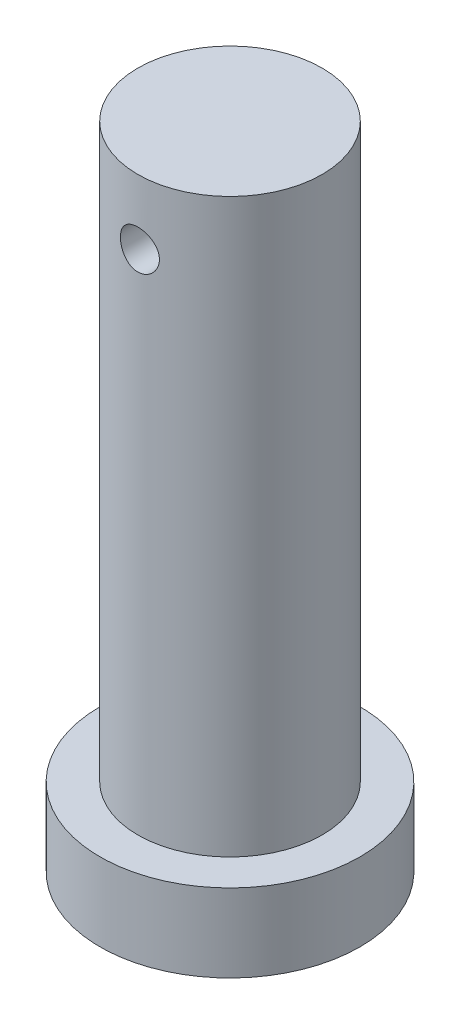
ISO-10303-21;
HEADER;
FILE_DESCRIPTION(('STEP AP214'),'2;1');
FILE_NAME('part.step','',(''),(''),'','','');
FILE_SCHEMA(('AUTOMOTIVE_DESIGN { 1 0 10303 214 1 1 1 1 }'));
ENDSEC;
DATA;
#1=APPLICATION_CONTEXT('core data for automotive mechanical design processes');
#2=APPLICATION_PROTOCOL_DEFINITION('international standard','automotive_design',2000,#1);
#3=PRODUCT_CONTEXT('',#1,'mechanical');
#4=PRODUCT('Part','Part','',(#3));
#5=PRODUCT_RELATED_PRODUCT_CATEGORY('part','',(#4));
#6=PRODUCT_DEFINITION_FORMATION('','',#4);
#7=PRODUCT_DEFINITION_CONTEXT('part definition',#1,'design');
#8=PRODUCT_DEFINITION('design','',#6,#7);
#9=PRODUCT_DEFINITION_SHAPE('','',#8);
#10=(LENGTH_UNIT() NAMED_UNIT(*) SI_UNIT(.MILLI.,.METRE.));
#11=(NAMED_UNIT(*) PLANE_ANGLE_UNIT() SI_UNIT($,.RADIAN.));
#12=(NAMED_UNIT(*) SI_UNIT($,.STERADIAN.) SOLID_ANGLE_UNIT());
#13=UNCERTAINTY_MEASURE_WITH_UNIT(LENGTH_MEASURE(1.E-05),#10,'distance_accuracy_value','');
#14=(GEOMETRIC_REPRESENTATION_CONTEXT(3) GLOBAL_UNCERTAINTY_ASSIGNED_CONTEXT((#13)) GLOBAL_UNIT_ASSIGNED_CONTEXT((#10,
#11,#12)) REPRESENTATION_CONTEXT('',''));
#15=CARTESIAN_POINT('',(0.,0.,0.));
#16=DIRECTION('',(0.,0.,1.));
#17=DIRECTION('',(1.,0.,0.));
#18=AXIS2_PLACEMENT_3D('',#15,#16,#17);
#19=CARTESIAN_POINT('',(0.,0.,0.));
#20=DIRECTION('',(0.,1.,0.));
#21=DIRECTION('',(-1.,0.,0.));
#22=AXIS2_PLACEMENT_3D('',#19,#20,#21);
#23=PLANE('',#22);
#24=CARTESIAN_POINT('',(0.,0.,0.));
#25=DIRECTION('',(0.,1.,0.));
#26=DIRECTION('',(-1.,0.,0.));
#27=AXIS2_PLACEMENT_3D('',#24,#25,#26);
#28=CIRCLE('',#27,25.);
#29=CARTESIAN_POINT('',(-25.,0.,0.));
#30=VERTEX_POINT('',#29);
#31=EDGE_CURVE('E10',#30,#30,#28,.T.);
#32=ORIENTED_EDGE('',*,*,#31,.F.);
#33=EDGE_LOOP('',(#32));
#34=FACE_BOUND('',#33,.T.);
#35=ADVANCED_FACE('F44',(#34),#23,.F.);
#36=CARTESIAN_POINT('',(0.,125.,0.));
#37=DIRECTION('',(0.,1.,0.));
#38=DIRECTION('',(-1.,0.,0.));
#39=AXIS2_PLACEMENT_3D('',#36,#37,#38);
#40=CYLINDRICAL_SURFACE('',#39,25.);
#41=CARTESIAN_POINT('',(0.,15.,0.));
#42=DIRECTION('',(0.,1.,0.));
#43=DIRECTION('',(-1.,0.,0.));
#44=AXIS2_PLACEMENT_3D('',#41,#42,#43);
#45=CIRCLE('',#44,25.);
#46=CARTESIAN_POINT('',(-25.,15.,0.));
#47=VERTEX_POINT('',#46);
#48=EDGE_CURVE('E57',#47,#47,#45,.T.);
#49=ORIENTED_EDGE('',*,*,#48,.F.);
#50=EDGE_LOOP('',(#49));
#51=FACE_BOUND('',#50,.T.);
#52=ORIENTED_EDGE('',*,*,#31,.T.);
#53=EDGE_LOOP('',(#52));
#54=FACE_BOUND('',#53,.T.);
#55=ADVANCED_FACE('F93',(#51,#54),#40,.T.);
#56=CARTESIAN_POINT('',(25.,15.,0.));
#57=DIRECTION('',(0.,-1.,0.));
#58=DIRECTION('',(1.,0.,0.));
#59=AXIS2_PLACEMENT_3D('',#56,#57,#58);
#60=PLANE('',#59);
#61=CARTESIAN_POINT('',(0.,15.,0.));
#62=DIRECTION('',(0.,1.,0.));
#63=DIRECTION('',(-1.,0.,0.));
#64=AXIS2_PLACEMENT_3D('',#61,#62,#63);
#65=CIRCLE('',#64,17.7222);
#66=CARTESIAN_POINT('',(-17.7222,15.,0.));
#67=VERTEX_POINT('',#66);
#68=EDGE_CURVE('E65',#67,#67,#65,.T.);
#69=ORIENTED_EDGE('',*,*,#68,.F.);
#70=EDGE_LOOP('',(#69));
#71=FACE_BOUND('',#70,.T.);
#72=ORIENTED_EDGE('',*,*,#48,.T.);
#73=EDGE_LOOP('',(#72));
#74=FACE_BOUND('',#73,.T.);
#75=ADVANCED_FACE('F89',(#71,#74),#60,.F.);
#76=CARTESIAN_POINT('',(0.,125.,0.));
#77=DIRECTION('',(0.,1.,0.));
#78=DIRECTION('',(-1.,0.,0.));
#79=AXIS2_PLACEMENT_3D('',#76,#77,#78);
#80=CYLINDRICAL_SURFACE('',#79,17.7222);
#81=CARTESIAN_POINT('',(3.75,112.5,-17.3209085454545));
#82=CARTESIAN_POINT('',(3.74999262317846,112.708093377559,-17.3209127403599));
#83=CARTESIAN_POINT('',(3.73261997860774,112.916277044266,-17.3246994128075));
#84=CARTESIAN_POINT('',(3.66365734999549,113.326736132959,-17.3394113210448));
#85=CARTESIAN_POINT('',(3.61204159866976,113.529006985906,-17.35034193242));
#86=CARTESIAN_POINT('',(3.47628071020748,113.921643316706,-17.378049597833));
#87=CARTESIAN_POINT('',(3.39216995789181,114.112021132715,-17.3948204701126));
#88=CARTESIAN_POINT('',(3.19390346373044,114.475963940299,-17.4323116003607));
#89=CARTESIAN_POINT('',(3.0797487513,114.649529507645,-17.4530317230067));
#90=CARTESIAN_POINT('',(2.82271022430321,114.977671220932,-17.4964528436146));
#91=CARTESIAN_POINT('',(2.67944149998643,115.131942743113,-17.5191777906157));
#92=CARTESIAN_POINT('',(2.36907303755116,115.4144525696,-17.5638379340189));
#93=CARTESIAN_POINT('',(2.20197152130572,115.542688929732,-17.5857730713415));
#94=CARTESIAN_POINT('',(1.84664821708078,115.770684358623,-17.6266419499506));
#95=CARTESIAN_POINT('',(1.6582353617803,115.870151796008,-17.6455441445425));
#96=CARTESIAN_POINT('',(1.2669029854327,116.035901031209,-17.6779474301966));
#97=CARTESIAN_POINT('',(1.0639849888309,116.102186310525,-17.6914490878576));
#98=CARTESIAN_POINT('',(0.652567580719972,116.198735348537,-17.7113608065571));
#99=CARTESIAN_POINT('',(0.444194041340726,116.229514231484,-17.7178721830305));
#100=CARTESIAN_POINT('',(0.0251460275708728,116.255786023133,-17.7234202773815));
#101=CARTESIAN_POINT('',(-0.185528197367932,116.251282720109,-17.7224577977324));
#102=CARTESIAN_POINT('',(-0.599650668847648,116.207504380898,-17.7132444762233));
#103=CARTESIAN_POINT('',(-0.80316056402321,116.168784436707,-17.7051099896601));
#104=CARTESIAN_POINT('',(-1.20072724293187,116.058554884073,-17.6825986819167));
#105=CARTESIAN_POINT('',(-1.39478361731766,115.987043857135,-17.668221590692));
#106=CARTESIAN_POINT('',(-1.76949226205793,115.812762041542,-17.6346515461538));
#107=CARTESIAN_POINT('',(-1.95004234186692,115.709778093599,-17.6154259149491));
#108=CARTESIAN_POINT('',(-2.29150208321449,115.47563223176,-17.574271331142));
#109=CARTESIAN_POINT('',(-2.4524092261398,115.344466710367,-17.5523420325989));
#110=CARTESIAN_POINT('',(-2.75331424766757,115.054649805473,-17.5076914056489));
#111=CARTESIAN_POINT('',(-2.8928435251433,114.895512582164,-17.4849629705469));
#112=CARTESIAN_POINT('',(-3.14331748073307,114.555864767729,-17.4416780316321));
#113=CARTESIAN_POINT('',(-3.25426148100088,114.37535366991,-17.4211215793306));
#114=CARTESIAN_POINT('',(-3.44460544567756,113.997357726212,-17.3844910940221));
#115=CARTESIAN_POINT('',(-3.52392183288319,113.799829563272,-17.3684289703895));
#116=CARTESIAN_POINT('',(-3.64809745225986,113.393829338666,-17.3427742763144));
#117=CARTESIAN_POINT('',(-3.69296176518216,113.185358895537,-17.3331807519537));
#118=CARTESIAN_POINT('',(-3.74624324397612,112.76766009111,-17.321742710072));
#119=CARTESIAN_POINT('',(-3.75534053082154,112.558522345409,-17.3197536124913));
#120=CARTESIAN_POINT('',(-3.73866669739234,112.141718310905,-17.3233603789464));
#121=CARTESIAN_POINT('',(-3.71289780756497,111.934051928831,-17.3289557577907));
#122=CARTESIAN_POINT('',(-3.62781175603405,111.528421461802,-17.3469649281265));
#123=CARTESIAN_POINT('',(-3.56886480360998,111.330376071787,-17.3593034347225));
#124=CARTESIAN_POINT('',(-3.41949479846596,110.946972633265,-17.3893414522287));
#125=CARTESIAN_POINT('',(-3.32906889399049,110.76161573606,-17.4070414488305));
#126=CARTESIAN_POINT('',(-3.11779340887312,110.405894821698,-17.4461285497627));
#127=CARTESIAN_POINT('',(-2.99652228144576,110.235786744496,-17.467565329004));
#128=CARTESIAN_POINT('',(-2.72755439164384,109.918086323327,-17.5115775650936));
#129=CARTESIAN_POINT('',(-2.57985456808567,109.770496591289,-17.5341531536303));
#130=CARTESIAN_POINT('',(-2.25915377249306,109.499406461982,-17.5783730388198));
#131=CARTESIAN_POINT('',(-2.08575840667883,109.376368268524,-17.5999943920104));
#132=CARTESIAN_POINT('',(-1.72036426394339,109.161168561999,-17.6394568181403));
#133=CARTESIAN_POINT('',(-1.52836632473975,109.069005659377,-17.6572980611917));
#134=CARTESIAN_POINT('',(-1.13237181293258,108.918828173017,-17.6870928075675));
#135=CARTESIAN_POINT('',(-0.928456948272552,108.86060555932,-17.6990821038446));
#136=CARTESIAN_POINT('',(-0.513459944970111,108.779307778374,-17.7159763748215));
#137=CARTESIAN_POINT('',(-0.302378782011169,108.756227845952,-17.7208823099854));
#138=CARTESIAN_POINT('',(0.116560832719893,108.746073283603,-17.7230308401985));
#139=CARTESIAN_POINT('',(0.324402062843802,108.758306724024,-17.7204207074236));
#140=CARTESIAN_POINT('',(0.734994933660256,108.816891729548,-17.7081436067735));
#141=CARTESIAN_POINT('',(0.937746654628514,108.863242756171,-17.698476750275));
#142=CARTESIAN_POINT('',(1.33191041798981,108.988424776035,-17.6731806640817));
#143=CARTESIAN_POINT('',(1.52335293699509,109.067163450386,-17.6575683907202));
#144=CARTESIAN_POINT('',(1.89040430753438,109.254793312458,-17.6220539549752));
#145=CARTESIAN_POINT('',(2.066011728651,109.363687220555,-17.6021514055916));
#146=CARTESIAN_POINT('',(2.39980151247035,109.610823120376,-17.5597884397093));
#147=CARTESIAN_POINT('',(2.55761616742306,109.749555050576,-17.5372886507353));
#148=CARTESIAN_POINT('',(2.84796223724988,110.051433301696,-17.4924874475652));
#149=CARTESIAN_POINT('',(2.98048759586125,110.214585454104,-17.4701860821035));
#150=CARTESIAN_POINT('',(3.21805989106317,110.563091032504,-17.4280016019896));
#151=CARTESIAN_POINT('',(3.32274774875285,110.748693468642,-17.408151706626));
#152=CARTESIAN_POINT('',(3.49928129047303,111.135232094083,-17.3735304123889));
#153=CARTESIAN_POINT('',(3.57115555676738,111.336154759961,-17.3587545965321));
#154=CARTESIAN_POINT('',(3.6667550315034,111.69781940775,-17.3387719502576));
#155=CARTESIAN_POINT('',(3.69791362140268,111.856558370175,-17.3321164661325));
#156=CARTESIAN_POINT('',(3.73953852764503,112.176846817698,-17.3231832284598));
#157=CARTESIAN_POINT('',(3.75000572878646,112.338396182321,-17.3209052877212));
#158=CARTESIAN_POINT('',(3.75,112.5,-17.3209085454545));
#159=B_SPLINE_CURVE_WITH_KNOTS('',3,(#81,#82,#83,#84,#85,#86,#87,#88,#89,#90,#91,#92,#93,#94,
#95,#96,#97,#98,#99,#100,#101,#102,#103,#104,#105,#106,#107,#108,#109,#110,#111,#112,#113,#114,
#115,#116,#117,#118,#119,#120,#121,#122,#123,#124,#125,#126,#127,#128,#129,#130,#131,#132,#133,
#134,#135,#136,#137,#138,#139,#140,#141,#142,#143,#144,#145,#146,#147,#148,#149,#150,#151,#152,
#153,#154,#155,#156,#157,#158),.UNSPECIFIED.,.T.,.F.,(4,2,2,2,2,2,2,2,2,2,2,2,2,2,2,2,2,2,2,2,2,
2,2,2,2,2,2,2,2,2,2,2,2,2,2,2,2,2,4),(0.,0.623688090543544,1.24784602759236,1.87134530840722,
2.49482322865153,3.12715391539677,3.75953180403846,4.39811185432495,5.03662489022359,
5.66575306846343,6.29481369768977,6.91385275136083,7.53291858628581,8.1562737999039,
8.77970885623473,9.41529368384849,10.0508935817771,10.6881621200715,11.3253366603958,
11.9503347936719,12.5752929466693,13.1934120958477,13.8115872565353,14.4387129619278,
15.0659113531267,15.7039879007302,16.3420357275908,16.9761304972284,17.6101392790794,
18.2318101300843,18.853471169442,19.4733723505521,20.0933294726495,20.7243716110697,
21.3555646818813,21.9945428733454,22.6329634162214,23.1173358066246,23.6016874840072),.UNSPECIFIED.);
#160=CARTESIAN_POINT('',(3.75,112.5,-17.3209085454545));
#161=VERTEX_POINT('',#160);
#162=EDGE_CURVE('E47',#161,#161,#159,.T.);
#163=ORIENTED_EDGE('',*,*,#162,.T.);
#164=EDGE_LOOP('',(#163));
#165=FACE_BOUND('',#164,.T.);
#166=CARTESIAN_POINT('',(3.75,112.5,17.3209085454545));
#167=CARTESIAN_POINT('',(3.74999262317846,112.291906622441,17.3209127403599));
#168=CARTESIAN_POINT('',(3.73261997860774,112.083722955734,17.3246994128075));
#169=CARTESIAN_POINT('',(3.66365734999549,111.673263867041,17.3394113210448));
#170=CARTESIAN_POINT('',(3.61204159866976,111.470993014094,17.35034193242));
#171=CARTESIAN_POINT('',(3.47628071020748,111.078356683294,17.378049597833));
#172=CARTESIAN_POINT('',(3.39216995789181,110.887978867285,17.3948204701126));
#173=CARTESIAN_POINT('',(3.19390346373044,110.524036059701,17.4323116003607));
#174=CARTESIAN_POINT('',(3.0797487513,110.350470492355,17.4530317230067));
#175=CARTESIAN_POINT('',(2.82271022430321,110.022328779068,17.4964528436146));
#176=CARTESIAN_POINT('',(2.67944149998642,109.868057256887,17.5191777906157));
#177=CARTESIAN_POINT('',(2.36907303755116,109.5855474304,17.5638379340189));
#178=CARTESIAN_POINT('',(2.20197152130572,109.457311070268,17.5857730713415));
#179=CARTESIAN_POINT('',(1.84664821708078,109.229315641377,17.6266419499506));
#180=CARTESIAN_POINT('',(1.6582353617803,109.129848203993,17.6455441445425));
#181=CARTESIAN_POINT('',(1.2669029854327,108.964098968791,17.6779474301966));
#182=CARTESIAN_POINT('',(1.0639849888309,108.897813689475,17.6914490878576));
#183=CARTESIAN_POINT('',(0.652567580719972,108.801264651463,17.7113608065571));
#184=CARTESIAN_POINT('',(0.444194041340726,108.770485768516,17.7178721830305));
#185=CARTESIAN_POINT('',(0.0251460275708728,108.744213976867,17.7234202773815));
#186=CARTESIAN_POINT('',(-0.185528197367932,108.748717279891,17.7224577977324));
#187=CARTESIAN_POINT('',(-0.599650668847648,108.792495619102,17.7132444762233));
#188=CARTESIAN_POINT('',(-0.80316056402321,108.831215563293,17.7051099896601));
#189=CARTESIAN_POINT('',(-1.20072724293187,108.941445115927,17.6825986819167));
#190=CARTESIAN_POINT('',(-1.39478361731766,109.012956142865,17.668221590692));
#191=CARTESIAN_POINT('',(-1.76949226205793,109.187237958458,17.6346515461538));
#192=CARTESIAN_POINT('',(-1.95004234186692,109.290221906401,17.6154259149491));
#193=CARTESIAN_POINT('',(-2.29150208321449,109.52436776824,17.574271331142));
#194=CARTESIAN_POINT('',(-2.4524092261398,109.655533289633,17.5523420325989));
#195=CARTESIAN_POINT('',(-2.75331424766757,109.945350194527,17.5076914056489));
#196=CARTESIAN_POINT('',(-2.89284352514331,110.104487417836,17.4849629705469));
#197=CARTESIAN_POINT('',(-3.14331748073307,110.444135232271,17.4416780316321));
#198=CARTESIAN_POINT('',(-3.25426148100088,110.62464633009,17.4211215793306));
#199=CARTESIAN_POINT('',(-3.44460544567756,111.002642273789,17.3844910940221));
#200=CARTESIAN_POINT('',(-3.52392183288319,111.200170436728,17.3684289703895));
#201=CARTESIAN_POINT('',(-3.64809745225987,111.606170661334,17.3427742763144));
#202=CARTESIAN_POINT('',(-3.69296176518216,111.814641104463,17.3331807519537));
#203=CARTESIAN_POINT('',(-3.74624324397612,112.23233990889,17.321742710072));
#204=CARTESIAN_POINT('',(-3.75534053082154,112.441477654591,17.3197536124913));
#205=CARTESIAN_POINT('',(-3.73866669739234,112.858281689095,17.3233603789464));
#206=CARTESIAN_POINT('',(-3.71289780756497,113.065948071169,17.3289557577907));
#207=CARTESIAN_POINT('',(-3.62781175603405,113.471578538198,17.3469649281265));
#208=CARTESIAN_POINT('',(-3.56886480360998,113.669623928213,17.3593034347225));
#209=CARTESIAN_POINT('',(-3.41949479846595,114.053027366735,17.3893414522287));
#210=CARTESIAN_POINT('',(-3.32906889399048,114.23838426394,17.4070414488305));
#211=CARTESIAN_POINT('',(-3.11779340887312,114.594105178302,17.4461285497627));
#212=CARTESIAN_POINT('',(-2.99652228144576,114.764213255504,17.467565329004));
#213=CARTESIAN_POINT('',(-2.72755439164384,115.081913676673,17.5115775650936));
#214=CARTESIAN_POINT('',(-2.57985456808568,115.229503408711,17.5341531536303));
#215=CARTESIAN_POINT('',(-2.25915377249306,115.500593538018,17.5783730388198));
#216=CARTESIAN_POINT('',(-2.08575840667883,115.623631731476,17.5999943920104));
#217=CARTESIAN_POINT('',(-1.72036426394339,115.838831438001,17.6394568181403));
#218=CARTESIAN_POINT('',(-1.52836632473975,115.930994340623,17.6572980611917));
#219=CARTESIAN_POINT('',(-1.13237181293258,116.081171826983,17.6870928075675));
#220=CARTESIAN_POINT('',(-0.928456948272554,116.13939444068,17.6990821038446));
#221=CARTESIAN_POINT('',(-0.513459944970111,116.220692221626,17.7159763748215));
#222=CARTESIAN_POINT('',(-0.302378782011169,116.243772154048,17.7208823099854));
#223=CARTESIAN_POINT('',(0.116560832719892,116.253926716397,17.7230308401985));
#224=CARTESIAN_POINT('',(0.324402062843802,116.241693275976,17.7204207074236));
#225=CARTESIAN_POINT('',(0.734994933660255,116.183108270452,17.7081436067735));
#226=CARTESIAN_POINT('',(0.937746654628513,116.136757243829,17.698476750275));
#227=CARTESIAN_POINT('',(1.33191041798981,116.011575223965,17.6731806640817));
#228=CARTESIAN_POINT('',(1.52335293699509,115.932836549614,17.6575683907202));
#229=CARTESIAN_POINT('',(1.89040430753438,115.745206687542,17.6220539549752));
#230=CARTESIAN_POINT('',(2.066011728651,115.636312779445,17.6021514055916));
#231=CARTESIAN_POINT('',(2.39980151247036,115.389176879624,17.5597884397093));
#232=CARTESIAN_POINT('',(2.55761616742307,115.250444949424,17.5372886507353));
#233=CARTESIAN_POINT('',(2.84796223724989,114.948566698304,17.4924874475652));
#234=CARTESIAN_POINT('',(2.98048759586125,114.785414545896,17.4701860821035));
#235=CARTESIAN_POINT('',(3.21805989106317,114.436908967496,17.4280016019896));
#236=CARTESIAN_POINT('',(3.32274774875285,114.251306531358,17.408151706626));
#237=CARTESIAN_POINT('',(3.49928129047303,113.864767905917,17.3735304123889));
#238=CARTESIAN_POINT('',(3.57115555676738,113.663845240039,17.3587545965321));
#239=CARTESIAN_POINT('',(3.6667550315034,113.30218059225,17.3387719502576));
#240=CARTESIAN_POINT('',(3.69791362140268,113.143441629825,17.3321164661325));
#241=CARTESIAN_POINT('',(3.73953852764503,112.823153182302,17.3231832284598));
#242=CARTESIAN_POINT('',(3.75000572878646,112.661603817679,17.3209052877212));
#243=CARTESIAN_POINT('',(3.75,112.5,17.3209085454545));
#244=B_SPLINE_CURVE_WITH_KNOTS('',3,(#166,#167,#168,#169,#170,#171,#172,#173,#174,#175,#176,
#177,#178,#179,#180,#181,#182,#183,#184,#185,#186,#187,#188,#189,#190,#191,#192,#193,#194,#195,
#196,#197,#198,#199,#200,#201,#202,#203,#204,#205,#206,#207,#208,#209,#210,#211,#212,#213,#214,
#215,#216,#217,#218,#219,#220,#221,#222,#223,#224,#225,#226,#227,#228,#229,#230,#231,#232,#233,
#234,#235,#236,#237,#238,#239,#240,#241,#242,#243),.UNSPECIFIED.,.T.,.F.,(4,2,2,2,2,2,2,2,2,2,2,
2,2,2,2,2,2,2,2,2,2,2,2,2,2,2,2,2,2,2,2,2,2,2,2,2,2,2,4),(0.,0.62368809054353,1.24784602759236,
1.87134530840722,2.49482322865153,3.12715391539677,3.75953180403846,4.39811185432495,
5.03662489022359,5.66575306846343,6.29481369768977,6.91385275136083,7.53291858628581,
8.1562737999039,8.77970885623473,9.4152936838485,10.0508935817771,10.6881621200715,
11.3253366603958,11.9503347936719,12.5752929466693,13.1934120958477,13.8115872565353,
14.4387129619278,15.0659113531267,15.7039879007302,16.3420357275908,16.9761304972284,
17.6101392790794,18.2318101300843,18.853471169442,19.4733723505521,20.0933294726496,
20.7243716110697,21.3555646818814,21.9945428733454,22.6329634162214,23.1173358066246,
23.6016874840072),.UNSPECIFIED.);
#245=CARTESIAN_POINT('',(3.75,112.5,17.3209085454545));
#246=VERTEX_POINT('',#245);
#247=EDGE_CURVE('E68',#246,#246,#244,.T.);
#248=ORIENTED_EDGE('',*,*,#247,.T.);
#249=EDGE_LOOP('',(#248));
#250=FACE_BOUND('',#249,.T.);
#251=CARTESIAN_POINT('',(0.,125.,0.));
#252=DIRECTION('',(0.,1.,0.));
#253=DIRECTION('',(-1.,0.,0.));
#254=AXIS2_PLACEMENT_3D('',#251,#252,#253);
#255=CIRCLE('',#254,17.7222);
#256=CARTESIAN_POINT('',(-17.7222,125.,0.));
#257=VERTEX_POINT('',#256);
#258=EDGE_CURVE('E111',#257,#257,#255,.T.);
#259=ORIENTED_EDGE('',*,*,#258,.F.);
#260=EDGE_LOOP('',(#259));
#261=FACE_BOUND('',#260,.T.);
#262=ORIENTED_EDGE('',*,*,#68,.T.);
#263=EDGE_LOOP('',(#262));
#264=FACE_BOUND('',#263,.T.);
#265=ADVANCED_FACE('F74',(#165,#250,#261,#264),#80,.T.);
#266=CARTESIAN_POINT('',(17.7222,125.,0.));
#267=DIRECTION('',(0.,-1.,0.));
#268=DIRECTION('',(1.,0.,0.));
#269=AXIS2_PLACEMENT_3D('',#266,#267,#268);
#270=PLANE('',#269);
#271=ORIENTED_EDGE('',*,*,#258,.T.);
#272=EDGE_LOOP('',(#271));
#273=FACE_BOUND('',#272,.T.);
#274=ADVANCED_FACE('F81',(#273),#270,.F.);
#275=CARTESIAN_POINT('',(0.,112.5,-25.));
#276=DIRECTION('',(0.,0.,1.));
#277=DIRECTION('',(1.,0.,0.));
#278=AXIS2_PLACEMENT_3D('',#275,#276,#277);
#279=CYLINDRICAL_SURFACE('',#278,3.75);
#280=ORIENTED_EDGE('',*,*,#247,.F.);
#281=EDGE_LOOP('',(#280));
#282=FACE_BOUND('',#281,.T.);
#283=ORIENTED_EDGE('',*,*,#162,.F.);
#284=EDGE_LOOP('',(#283));
#285=FACE_BOUND('',#284,.T.);
#286=ADVANCED_FACE('F78',(#282,#285),#279,.F.);
#287=CLOSED_SHELL('',(#35,#55,#75,#265,#274,#286));
#288=MANIFOLD_SOLID_BREP('B2',#287);
#289=ADVANCED_BREP_SHAPE_REPRESENTATION('',(#18,#288),#14);
#290=SHAPE_DEFINITION_REPRESENTATION(#9,#289);
ENDSEC;
END-ISO-10303-21;
